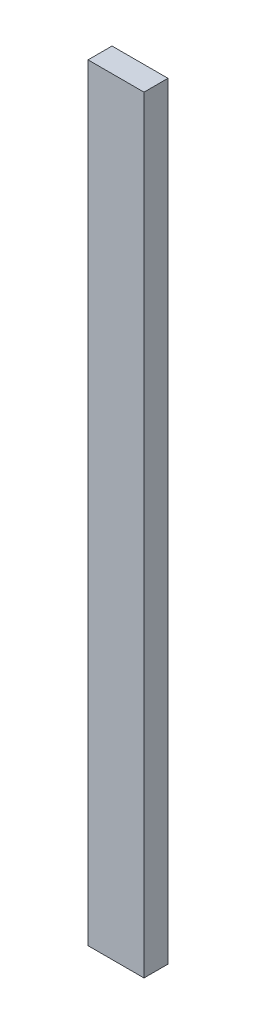
ISO-10303-21;
HEADER;
FILE_DESCRIPTION(('STEP AP214'),'2;1');
FILE_NAME('part.step','',(''),(''),'','','');
FILE_SCHEMA(('AUTOMOTIVE_DESIGN { 1 0 10303 214 1 1 1 1 }'));
ENDSEC;
DATA;
#1=APPLICATION_CONTEXT('core data for automotive mechanical design processes');
#2=APPLICATION_PROTOCOL_DEFINITION('international standard','automotive_design',2000,#1);
#3=PRODUCT_CONTEXT('',#1,'mechanical');
#4=PRODUCT('Part','Part','',(#3));
#5=PRODUCT_RELATED_PRODUCT_CATEGORY('part','',(#4));
#6=PRODUCT_DEFINITION_FORMATION('','',#4);
#7=PRODUCT_DEFINITION_CONTEXT('part definition',#1,'design');
#8=PRODUCT_DEFINITION('design','',#6,#7);
#9=PRODUCT_DEFINITION_SHAPE('','',#8);
#10=(LENGTH_UNIT() NAMED_UNIT(*) SI_UNIT(.MILLI.,.METRE.));
#11=(NAMED_UNIT(*) PLANE_ANGLE_UNIT() SI_UNIT($,.RADIAN.));
#12=(NAMED_UNIT(*) SI_UNIT($,.STERADIAN.) SOLID_ANGLE_UNIT());
#13=UNCERTAINTY_MEASURE_WITH_UNIT(LENGTH_MEASURE(1.E-05),#10,'distance_accuracy_value','');
#14=(GEOMETRIC_REPRESENTATION_CONTEXT(3) GLOBAL_UNCERTAINTY_ASSIGNED_CONTEXT((#13)) GLOBAL_UNIT_ASSIGNED_CONTEXT((#10,
#11,#12)) REPRESENTATION_CONTEXT('',''));
#15=CARTESIAN_POINT('',(0.,0.,0.));
#16=DIRECTION('',(0.,0.,1.));
#17=DIRECTION('',(1.,0.,0.));
#18=AXIS2_PLACEMENT_3D('',#15,#16,#17);
#19=CARTESIAN_POINT('',(0.,0.,38.1));
#20=DIRECTION('',(1.,0.,0.));
#21=DIRECTION('',(0.,1.,0.));
#22=AXIS2_PLACEMENT_3D('',#19,#20,#21);
#23=PLANE('',#22);
#24=DIRECTION('',(0.,-1.,0.));
#25=VECTOR('',#24,1.);
#26=CARTESIAN_POINT('',(0.,0.,0.));
#27=LINE('',#26,#25);
#28=CARTESIAN_POINT('',(-1.38777878078145E-13,1219.2,0.));
#29=VERTEX_POINT('',#28);
#30=CARTESIAN_POINT('',(0.,0.,0.));
#31=VERTEX_POINT('',#30);
#32=EDGE_CURVE('E96',#29,#31,#27,.T.);
#33=ORIENTED_EDGE('',*,*,#32,.T.);
#34=DIRECTION('',(0.,0.,-1.));
#35=VECTOR('',#34,1.);
#36=CARTESIAN_POINT('',(0.,0.,38.1));
#37=LINE('',#36,#35);
#38=CARTESIAN_POINT('',(0.,0.,38.1));
#39=VERTEX_POINT('',#38);
#40=EDGE_CURVE('E11',#39,#31,#37,.T.);
#41=ORIENTED_EDGE('',*,*,#40,.F.);
#42=DIRECTION('',(0.,-1.,0.));
#43=VECTOR('',#42,1.);
#44=CARTESIAN_POINT('',(0.,0.,38.1));
#45=LINE('',#44,#43);
#46=CARTESIAN_POINT('',(-1.38777878078145E-13,1219.2,38.1));
#47=VERTEX_POINT('',#46);
#48=EDGE_CURVE('E84',#47,#39,#45,.T.);
#49=ORIENTED_EDGE('',*,*,#48,.F.);
#50=DIRECTION('',(0.,0.,-1.));
#51=VECTOR('',#50,1.);
#52=CARTESIAN_POINT('',(-1.38777878078145E-13,1219.2,38.1));
#53=LINE('',#52,#51);
#54=EDGE_CURVE('E92',#47,#29,#53,.T.);
#55=ORIENTED_EDGE('',*,*,#54,.T.);
#56=EDGE_LOOP('',(#33,#41,#49,#55));
#57=FACE_BOUND('',#56,.T.);
#58=ADVANCED_FACE('F33',(#57),#23,.F.);
#59=CARTESIAN_POINT('',(0.,0.,38.1));
#60=DIRECTION('',(0.,1.,0.));
#61=DIRECTION('',(0.,0.,1.));
#62=AXIS2_PLACEMENT_3D('',#59,#60,#61);
#63=PLANE('',#62);
#64=DIRECTION('',(1.,0.,0.));
#65=VECTOR('',#64,1.);
#66=CARTESIAN_POINT('',(0.,0.,0.));
#67=LINE('',#66,#65);
#68=CARTESIAN_POINT('',(88.9000000000001,0.,0.));
#69=VERTEX_POINT('',#68);
#70=EDGE_CURVE('E88',#31,#69,#67,.T.);
#71=ORIENTED_EDGE('',*,*,#70,.T.);
#72=DIRECTION('',(0.,0.,-1.));
#73=VECTOR('',#72,1.);
#74=CARTESIAN_POINT('',(88.9000000000001,0.,38.1));
#75=LINE('',#74,#73);
#76=CARTESIAN_POINT('',(88.9000000000001,0.,38.1));
#77=VERTEX_POINT('',#76);
#78=EDGE_CURVE('E41',#77,#69,#75,.T.);
#79=ORIENTED_EDGE('',*,*,#78,.F.);
#80=DIRECTION('',(1.,0.,0.));
#81=VECTOR('',#80,1.);
#82=CARTESIAN_POINT('',(0.,0.,38.1));
#83=LINE('',#82,#81);
#84=EDGE_CURVE('E79',#39,#77,#83,.T.);
#85=ORIENTED_EDGE('',*,*,#84,.F.);
#86=ORIENTED_EDGE('',*,*,#40,.T.);
#87=EDGE_LOOP('',(#71,#79,#85,#86));
#88=FACE_BOUND('',#87,.T.);
#89=ADVANCED_FACE('F87',(#88),#63,.F.);
#90=CARTESIAN_POINT('',(88.9000000000001,0.,38.1));
#91=DIRECTION('',(-1.,0.,0.));
#92=DIRECTION('',(0.,-1.,0.));
#93=AXIS2_PLACEMENT_3D('',#90,#91,#92);
#94=PLANE('',#93);
#95=DIRECTION('',(0.,1.,0.));
#96=VECTOR('',#95,1.);
#97=CARTESIAN_POINT('',(88.9000000000001,0.,0.));
#98=LINE('',#97,#96);
#99=CARTESIAN_POINT('',(88.9,1219.2,0.));
#100=VERTEX_POINT('',#99);
#101=EDGE_CURVE('E66',#69,#100,#98,.T.);
#102=ORIENTED_EDGE('',*,*,#101,.T.);
#103=DIRECTION('',(0.,0.,-1.));
#104=VECTOR('',#103,1.);
#105=CARTESIAN_POINT('',(88.9,1219.2,38.1));
#106=LINE('',#105,#104);
#107=CARTESIAN_POINT('',(88.9,1219.2,38.1));
#108=VERTEX_POINT('',#107);
#109=EDGE_CURVE('E89',#108,#100,#106,.T.);
#110=ORIENTED_EDGE('',*,*,#109,.F.);
#111=DIRECTION('',(0.,1.,0.));
#112=VECTOR('',#111,1.);
#113=CARTESIAN_POINT('',(88.9000000000001,0.,38.1));
#114=LINE('',#113,#112);
#115=EDGE_CURVE('E82',#77,#108,#114,.T.);
#116=ORIENTED_EDGE('',*,*,#115,.F.);
#117=ORIENTED_EDGE('',*,*,#78,.T.);
#118=EDGE_LOOP('',(#102,#110,#116,#117));
#119=FACE_BOUND('',#118,.T.);
#120=ADVANCED_FACE('F90',(#119),#94,.F.);
#121=CARTESIAN_POINT('',(88.9,1219.2,38.1));
#122=DIRECTION('',(0.,-1.,0.));
#123=DIRECTION('',(0.,0.,-1.));
#124=AXIS2_PLACEMENT_3D('',#121,#122,#123);
#125=PLANE('',#124);
#126=DIRECTION('',(-1.,0.,0.));
#127=VECTOR('',#126,1.);
#128=CARTESIAN_POINT('',(88.9,1219.2,0.));
#129=LINE('',#128,#127);
#130=EDGE_CURVE('E72',#100,#29,#129,.T.);
#131=ORIENTED_EDGE('',*,*,#130,.T.);
#132=ORIENTED_EDGE('',*,*,#54,.F.);
#133=DIRECTION('',(-1.,0.,0.));
#134=VECTOR('',#133,1.);
#135=CARTESIAN_POINT('',(88.9,1219.2,38.1));
#136=LINE('',#135,#134);
#137=EDGE_CURVE('E49',#108,#47,#136,.T.);
#138=ORIENTED_EDGE('',*,*,#137,.F.);
#139=ORIENTED_EDGE('',*,*,#109,.T.);
#140=EDGE_LOOP('',(#131,#132,#138,#139));
#141=FACE_BOUND('',#140,.T.);
#142=ADVANCED_FACE('F103',(#141),#125,.F.);
#143=CARTESIAN_POINT('',(0.,0.,38.1));
#144=DIRECTION('',(0.,0.,1.));
#145=DIRECTION('',(1.,0.,0.));
#146=AXIS2_PLACEMENT_3D('',#143,#144,#145);
#147=PLANE('',#146);
#148=ORIENTED_EDGE('',*,*,#48,.T.);
#149=ORIENTED_EDGE('',*,*,#84,.T.);
#150=ORIENTED_EDGE('',*,*,#115,.T.);
#151=ORIENTED_EDGE('',*,*,#137,.T.);
#152=EDGE_LOOP('',(#148,#149,#150,#151));
#153=FACE_BOUND('',#152,.T.);
#154=ADVANCED_FACE('F80',(#153),#147,.T.);
#155=CARTESIAN_POINT('',(0.,0.,0.));
#156=DIRECTION('',(0.,0.,1.));
#157=DIRECTION('',(1.,0.,0.));
#158=AXIS2_PLACEMENT_3D('',#155,#156,#157);
#159=PLANE('',#158);
#160=ORIENTED_EDGE('',*,*,#32,.F.);
#161=ORIENTED_EDGE('',*,*,#130,.F.);
#162=ORIENTED_EDGE('',*,*,#101,.F.);
#163=ORIENTED_EDGE('',*,*,#70,.F.);
#164=EDGE_LOOP('',(#160,#161,#162,#163));
#165=FACE_BOUND('',#164,.T.);
#166=ADVANCED_FACE('F106',(#165),#159,.F.);
#167=CLOSED_SHELL('',(#58,#89,#120,#142,#154,#166));
#168=MANIFOLD_SOLID_BREP('B2',#167);
#169=ADVANCED_BREP_SHAPE_REPRESENTATION('',(#18,#168),#14);
#170=SHAPE_DEFINITION_REPRESENTATION(#9,#169);
ENDSEC;
END-ISO-10303-21;
